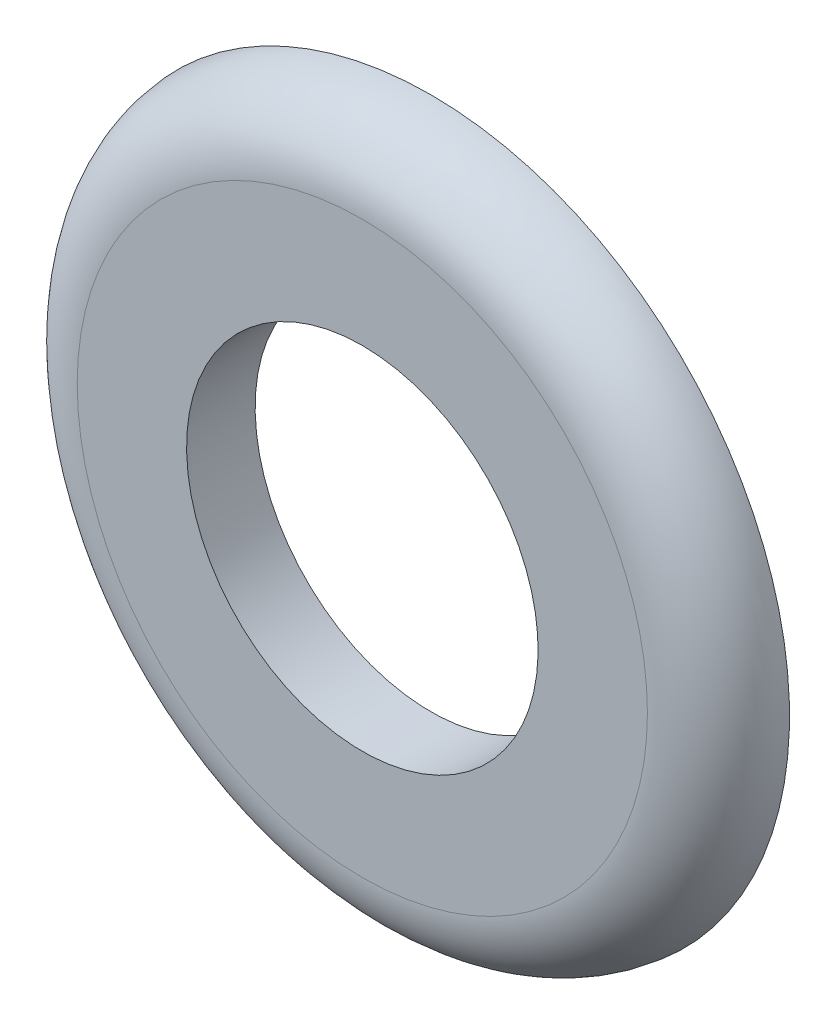
ISO-10303-21;
HEADER;
FILE_DESCRIPTION(('STEP AP214'),'2;1');
FILE_NAME('part.step','',(''),(''),'','','');
FILE_SCHEMA(('AUTOMOTIVE_DESIGN { 1 0 10303 214 1 1 1 1 }'));
ENDSEC;
DATA;
#1=APPLICATION_CONTEXT('core data for automotive mechanical design processes');
#2=APPLICATION_PROTOCOL_DEFINITION('international standard','automotive_design',2000,#1);
#3=PRODUCT_CONTEXT('',#1,'mechanical');
#4=PRODUCT('Part','Part','',(#3));
#5=PRODUCT_RELATED_PRODUCT_CATEGORY('part','',(#4));
#6=PRODUCT_DEFINITION_FORMATION('','',#4);
#7=PRODUCT_DEFINITION_CONTEXT('part definition',#1,'design');
#8=PRODUCT_DEFINITION('design','',#6,#7);
#9=PRODUCT_DEFINITION_SHAPE('','',#8);
#10=(LENGTH_UNIT() NAMED_UNIT(*) SI_UNIT(.MILLI.,.METRE.));
#11=(NAMED_UNIT(*) PLANE_ANGLE_UNIT() SI_UNIT($,.RADIAN.));
#12=(NAMED_UNIT(*) SI_UNIT($,.STERADIAN.) SOLID_ANGLE_UNIT());
#13=UNCERTAINTY_MEASURE_WITH_UNIT(LENGTH_MEASURE(1.E-05),#10,'distance_accuracy_value','');
#14=(GEOMETRIC_REPRESENTATION_CONTEXT(3) GLOBAL_UNCERTAINTY_ASSIGNED_CONTEXT((#13)) GLOBAL_UNIT_ASSIGNED_CONTEXT((#10,
#11,#12)) REPRESENTATION_CONTEXT('',''));
#15=CARTESIAN_POINT('',(0.,0.,0.));
#16=DIRECTION('',(0.,0.,1.));
#17=DIRECTION('',(1.,0.,0.));
#18=AXIS2_PLACEMENT_3D('',#15,#16,#17);
#19=CARTESIAN_POINT('',(0.,4.23333333333334,7.7089));
#20=DIRECTION('',(0.,0.,1.));
#21=DIRECTION('',(0.,-1.,0.));
#22=AXIS2_PLACEMENT_3D('',#19,#20,#21);
#23=PLANE('',#22);
#24=CARTESIAN_POINT('',(0.,0.,7.7089));
#25=DIRECTION('',(0.,0.,-1.));
#26=DIRECTION('',(0.,1.,0.));
#27=AXIS2_PLACEMENT_3D('',#24,#25,#26);
#28=CIRCLE('',#27,2.60990835569695);
#29=CARTESIAN_POINT('',(0.,2.60990835569695,7.7089));
#30=VERTEX_POINT('',#29);
#31=EDGE_CURVE('E21',#30,#30,#28,.T.);
#32=ORIENTED_EDGE('',*,*,#31,.T.);
#33=EDGE_LOOP('',(#32));
#34=FACE_BOUND('',#33,.T.);
#35=CARTESIAN_POINT('',(0.,0.,7.70890000000001));
#36=DIRECTION('',(0.,0.,-1.));
#37=DIRECTION('',(0.,1.,0.));
#38=AXIS2_PLACEMENT_3D('',#35,#36,#37);
#39=CIRCLE('',#38,4.23333333333334);
#40=CARTESIAN_POINT('',(0.,4.23333333333334,7.7089));
#41=VERTEX_POINT('',#40);
#42=CARTESIAN_POINT('',(0.,-4.23333333333334,7.7089));
#43=VERTEX_POINT('',#42);
#44=EDGE_CURVE('E33',#41,#43,#39,.T.);
#45=ORIENTED_EDGE('',*,*,#44,.F.);
#46=CARTESIAN_POINT('',(0.,0.,7.70890000000001));
#47=DIRECTION('',(0.,0.,-1.));
#48=DIRECTION('',(0.,-1.,0.));
#49=AXIS2_PLACEMENT_3D('',#46,#47,#48);
#50=CIRCLE('',#49,4.23333333333334);
#51=EDGE_CURVE('E36',#43,#41,#50,.T.);
#52=ORIENTED_EDGE('',*,*,#51,.F.);
#53=EDGE_LOOP('',(#45,#52));
#54=FACE_BOUND('',#53,.T.);
#55=ADVANCED_FACE('F17',(#34,#54),#23,.T.);
#56=CARTESIAN_POINT('',(0.,0.,6.61458333333334));
#57=DIRECTION('',(0.,0.,-1.));
#58=DIRECTION('',(0.,1.,0.));
#59=AXIS2_PLACEMENT_3D('',#56,#57,#58);
#60=TOROIDAL_SURFACE('',#59,4.23333333333334,1.09431666666667);
#61=ORIENTED_EDGE('',*,*,#44,.T.);
#62=ORIENTED_EDGE('',*,*,#51,.T.);
#63=EDGE_LOOP('',(#61,#62));
#64=FACE_BOUND('',#63,.T.);
#65=CARTESIAN_POINT('',(0.,0.,6.69078333333334));
#66=DIRECTION('',(0.,0.,-1.));
#67=DIRECTION('',(0.,1.,0.));
#68=AXIS2_PLACEMENT_3D('',#65,#66,#67);
#69=CIRCLE('',#68,5.32499377822655);
#70=CARTESIAN_POINT('',(0.,5.32499377822655,6.69078333333334));
#71=VERTEX_POINT('',#70);
#72=EDGE_CURVE('E27',#71,#71,#69,.T.);
#73=ORIENTED_EDGE('',*,*,#72,.F.);
#74=EDGE_LOOP('',(#73));
#75=FACE_BOUND('',#74,.T.);
#76=ADVANCED_FACE('F43',(#64,#75),#60,.T.);
#77=CARTESIAN_POINT('',(0.,0.,6.69078333333334));
#78=DIRECTION('',(0.,0.,-1.));
#79=DIRECTION('',(0.,1.,0.));
#80=AXIS2_PLACEMENT_3D('',#77,#78,#79);
#81=CYLINDRICAL_SURFACE('',#80,2.60990835569695);
#82=CARTESIAN_POINT('',(0.,0.,6.69078333333334));
#83=DIRECTION('',(0.,0.,-1.));
#84=DIRECTION('',(0.,1.,0.));
#85=AXIS2_PLACEMENT_3D('',#82,#83,#84);
#86=CIRCLE('',#85,2.60990835569695);
#87=CARTESIAN_POINT('',(0.,2.60990835569695,6.69078333333334));
#88=VERTEX_POINT('',#87);
#89=EDGE_CURVE('E11',#88,#88,#86,.F.);
#90=ORIENTED_EDGE('',*,*,#89,.F.);
#91=EDGE_LOOP('',(#90));
#92=FACE_BOUND('',#91,.T.);
#93=ORIENTED_EDGE('',*,*,#31,.F.);
#94=EDGE_LOOP('',(#93));
#95=FACE_BOUND('',#94,.T.);
#96=ADVANCED_FACE('F60',(#92,#95),#81,.F.);
#97=CARTESIAN_POINT('',(0.,2.60990835569695,6.69078333333334));
#98=DIRECTION('',(0.,0.,-1.));
#99=DIRECTION('',(0.,1.,0.));
#100=AXIS2_PLACEMENT_3D('',#97,#98,#99);
#101=PLANE('',#100);
#102=ORIENTED_EDGE('',*,*,#89,.T.);
#103=EDGE_LOOP('',(#102));
#104=FACE_BOUND('',#103,.T.);
#105=ORIENTED_EDGE('',*,*,#72,.T.);
#106=EDGE_LOOP('',(#105));
#107=FACE_BOUND('',#106,.T.);
#108=ADVANCED_FACE('F86',(#104,#107),#101,.T.);
#109=CLOSED_SHELL('',(#55,#76,#96,#108));
#110=MANIFOLD_SOLID_BREP('B1',#109);
#111=ADVANCED_BREP_SHAPE_REPRESENTATION('',(#18,#110),#14);
#112=SHAPE_DEFINITION_REPRESENTATION(#9,#111);
ENDSEC;
END-ISO-10303-21;
